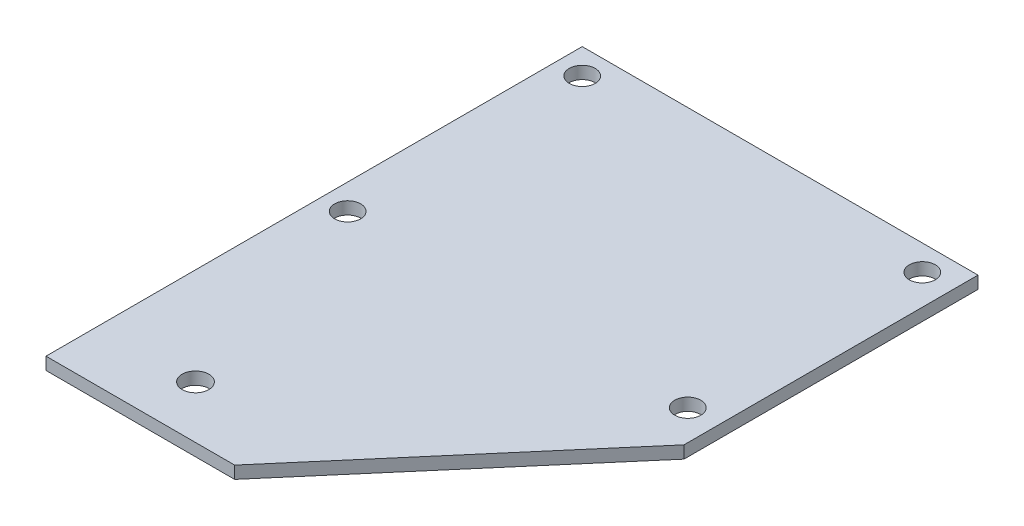
ISO-10303-21;
HEADER;
FILE_DESCRIPTION(('STEP AP214'),'2;1');
FILE_NAME('part.step','',(''),(''),'','','');
FILE_SCHEMA(('AUTOMOTIVE_DESIGN { 1 0 10303 214 1 1 1 1 }'));
ENDSEC;
DATA;
#1=APPLICATION_CONTEXT('core data for automotive mechanical design processes');
#2=APPLICATION_PROTOCOL_DEFINITION('international standard','automotive_design',2000,#1);
#3=PRODUCT_CONTEXT('',#1,'mechanical');
#4=PRODUCT('Part','Part','',(#3));
#5=PRODUCT_RELATED_PRODUCT_CATEGORY('part','',(#4));
#6=PRODUCT_DEFINITION_FORMATION('','',#4);
#7=PRODUCT_DEFINITION_CONTEXT('part definition',#1,'design');
#8=PRODUCT_DEFINITION('design','',#6,#7);
#9=PRODUCT_DEFINITION_SHAPE('','',#8);
#10=(LENGTH_UNIT() NAMED_UNIT(*) SI_UNIT(.MILLI.,.METRE.));
#11=(NAMED_UNIT(*) PLANE_ANGLE_UNIT() SI_UNIT($,.RADIAN.));
#12=(NAMED_UNIT(*) SI_UNIT($,.STERADIAN.) SOLID_ANGLE_UNIT());
#13=UNCERTAINTY_MEASURE_WITH_UNIT(LENGTH_MEASURE(1.E-05),#10,'distance_accuracy_value','');
#14=(GEOMETRIC_REPRESENTATION_CONTEXT(3) GLOBAL_UNCERTAINTY_ASSIGNED_CONTEXT((#13)) GLOBAL_UNIT_ASSIGNED_CONTEXT((#10,
#11,#12)) REPRESENTATION_CONTEXT('',''));
#15=CARTESIAN_POINT('',(0.,0.,0.));
#16=DIRECTION('',(0.,0.,1.));
#17=DIRECTION('',(1.,0.,0.));
#18=AXIS2_PLACEMENT_3D('',#15,#16,#17);
#19=CARTESIAN_POINT('',(0.,3.175,0.));
#20=DIRECTION('',(0.,-1.,0.));
#21=DIRECTION('',(0.,0.,-1.));
#22=AXIS2_PLACEMENT_3D('',#19,#20,#21);
#23=PLANE('',#22);
#24=DIRECTION('',(0.,0.,-1.));
#25=VECTOR('',#24,1.);
#26=CARTESIAN_POINT('',(101.24,3.175,-68.58));
#27=LINE('',#26,#25);
#28=CARTESIAN_POINT('',(101.24,3.175,6.62));
#29=VERTEX_POINT('',#28);
#30=CARTESIAN_POINT('',(101.24,3.175,-68.58));
#31=VERTEX_POINT('',#30);
#32=EDGE_CURVE('E119',#29,#31,#27,.T.);
#33=ORIENTED_EDGE('',*,*,#32,.T.);
#34=DIRECTION('',(-1.,0.,0.));
#35=VECTOR('',#34,1.);
#36=CARTESIAN_POINT('',(0.,3.175,-68.58));
#37=LINE('',#36,#35);
#38=CARTESIAN_POINT('',(0.,3.175,-68.58));
#39=VERTEX_POINT('',#38);
#40=EDGE_CURVE('E86',#31,#39,#37,.T.);
#41=ORIENTED_EDGE('',*,*,#40,.T.);
#42=DIRECTION('',(0.,0.,1.));
#43=VECTOR('',#42,1.);
#44=CARTESIAN_POINT('',(0.,3.175,68.58));
#45=LINE('',#44,#43);
#46=CARTESIAN_POINT('',(0.,3.175,68.58));
#47=VERTEX_POINT('',#46);
#48=EDGE_CURVE('E90',#39,#47,#45,.T.);
#49=ORIENTED_EDGE('',*,*,#48,.T.);
#50=DIRECTION('',(1.,0.,0.));
#51=VECTOR('',#50,1.);
#52=CARTESIAN_POINT('',(48.26,3.175,68.58));
#53=LINE('',#52,#51);
#54=CARTESIAN_POINT('',(48.26,3.175,68.58));
#55=VERTEX_POINT('',#54);
#56=EDGE_CURVE('E94',#47,#55,#53,.T.);
#57=ORIENTED_EDGE('',*,*,#56,.T.);
#58=DIRECTION('',(0.649881739167687,0.,-0.760035344636276));
#59=VECTOR('',#58,1.);
#60=CARTESIAN_POINT('',(101.24,3.175,6.62));
#61=LINE('',#60,#59);
#62=EDGE_CURVE('E52',#55,#29,#61,.T.);
#63=ORIENTED_EDGE('',*,*,#62,.T.);
#64=EDGE_LOOP('',(#33,#41,#49,#57,#63));
#65=FACE_BOUND('',#64,.T.);
#66=CARTESIAN_POINT('',(93.5,3.175,-62.08));
#67=DIRECTION('',(0.,1.,0.));
#68=DIRECTION('',(0.,0.,1.));
#69=AXIS2_PLACEMENT_3D('',#66,#67,#68);
#70=CIRCLE('',#69,3.32999999999999);
#71=CARTESIAN_POINT('',(93.5,3.175,-58.75));
#72=VERTEX_POINT('',#71);
#73=EDGE_CURVE('E114',#72,#72,#70,.T.);
#74=ORIENTED_EDGE('',*,*,#73,.F.);
#75=EDGE_LOOP('',(#74));
#76=FACE_BOUND('',#75,.T.);
#77=CARTESIAN_POINT('',(6.5,3.175,-62.08));
#78=DIRECTION('',(0.,1.,0.));
#79=DIRECTION('',(0.,0.,1.));
#80=AXIS2_PLACEMENT_3D('',#77,#78,#79);
#81=CIRCLE('',#80,3.33000000000001);
#82=CARTESIAN_POINT('',(6.5,3.175,-58.75));
#83=VERTEX_POINT('',#82);
#84=EDGE_CURVE('E188',#83,#83,#81,.T.);
#85=ORIENTED_EDGE('',*,*,#84,.F.);
#86=EDGE_LOOP('',(#85));
#87=FACE_BOUND('',#86,.T.);
#88=CARTESIAN_POINT('',(93.5,3.175,-2.08000000000001));
#89=DIRECTION('',(0.,1.,0.));
#90=DIRECTION('',(0.,0.,1.));
#91=AXIS2_PLACEMENT_3D('',#88,#89,#90);
#92=CIRCLE('',#91,3.32999999999999);
#93=CARTESIAN_POINT('',(93.5,3.175,1.24999999999999));
#94=VERTEX_POINT('',#93);
#95=EDGE_CURVE('E182',#94,#94,#92,.T.);
#96=ORIENTED_EDGE('',*,*,#95,.F.);
#97=EDGE_LOOP('',(#96));
#98=FACE_BOUND('',#97,.T.);
#99=CARTESIAN_POINT('',(6.50000000000001,3.175,-2.08));
#100=DIRECTION('',(0.,1.,0.));
#101=DIRECTION('',(0.,0.,1.));
#102=AXIS2_PLACEMENT_3D('',#99,#100,#101);
#103=CIRCLE('',#102,3.33);
#104=CARTESIAN_POINT('',(6.50000000000001,3.175,1.25));
#105=VERTEX_POINT('',#104);
#106=EDGE_CURVE('E176',#105,#105,#103,.T.);
#107=ORIENTED_EDGE('',*,*,#106,.F.);
#108=EDGE_LOOP('',(#107));
#109=FACE_BOUND('',#108,.T.);
#110=CARTESIAN_POINT('',(24.82,3.175,55.16));
#111=DIRECTION('',(0.,1.,0.));
#112=DIRECTION('',(0.,0.,1.));
#113=AXIS2_PLACEMENT_3D('',#110,#111,#112);
#114=CIRCLE('',#113,3.41999999999999);
#115=CARTESIAN_POINT('',(24.82,3.175,58.58));
#116=VERTEX_POINT('',#115);
#117=EDGE_CURVE('E167',#116,#116,#114,.T.);
#118=ORIENTED_EDGE('',*,*,#117,.F.);
#119=EDGE_LOOP('',(#118));
#120=FACE_BOUND('',#119,.T.);
#121=ADVANCED_FACE('F35',(#65,#76,#87,#98,#109,#120),#23,.F.);
#122=CARTESIAN_POINT('',(0.,0.,0.));
#123=DIRECTION('',(0.,-1.,0.));
#124=DIRECTION('',(0.,0.,-1.));
#125=AXIS2_PLACEMENT_3D('',#122,#123,#124);
#126=PLANE('',#125);
#127=CARTESIAN_POINT('',(6.50000000000001,0.,-2.08));
#128=DIRECTION('',(0.,1.,0.));
#129=DIRECTION('',(0.,0.,1.));
#130=AXIS2_PLACEMENT_3D('',#127,#128,#129);
#131=CIRCLE('',#130,3.33);
#132=CARTESIAN_POINT('',(6.50000000000001,0.,1.25));
#133=VERTEX_POINT('',#132);
#134=EDGE_CURVE('E173',#133,#133,#131,.T.);
#135=ORIENTED_EDGE('',*,*,#134,.T.);
#136=EDGE_LOOP('',(#135));
#137=FACE_BOUND('',#136,.T.);
#138=CARTESIAN_POINT('',(6.5,0.,-62.08));
#139=DIRECTION('',(0.,1.,0.));
#140=DIRECTION('',(0.,0.,1.));
#141=AXIS2_PLACEMENT_3D('',#138,#139,#140);
#142=CIRCLE('',#141,3.33000000000001);
#143=CARTESIAN_POINT('',(6.5,0.,-58.75));
#144=VERTEX_POINT('',#143);
#145=EDGE_CURVE('E185',#144,#144,#142,.T.);
#146=ORIENTED_EDGE('',*,*,#145,.T.);
#147=EDGE_LOOP('',(#146));
#148=FACE_BOUND('',#147,.T.);
#149=DIRECTION('',(0.,0.,-1.));
#150=VECTOR('',#149,1.);
#151=CARTESIAN_POINT('',(101.24,0.,-68.58));
#152=LINE('',#151,#150);
#153=CARTESIAN_POINT('',(101.24,0.,6.62));
#154=VERTEX_POINT('',#153);
#155=CARTESIAN_POINT('',(101.24,0.,-68.58));
#156=VERTEX_POINT('',#155);
#157=EDGE_CURVE('E110',#154,#156,#152,.T.);
#158=ORIENTED_EDGE('',*,*,#157,.F.);
#159=DIRECTION('',(0.649881739167687,0.,-0.760035344636276));
#160=VECTOR('',#159,1.);
#161=CARTESIAN_POINT('',(101.24,0.,6.62));
#162=LINE('',#161,#160);
#163=CARTESIAN_POINT('',(48.26,0.,68.58));
#164=VERTEX_POINT('',#163);
#165=EDGE_CURVE('E78',#164,#154,#162,.T.);
#166=ORIENTED_EDGE('',*,*,#165,.F.);
#167=DIRECTION('',(1.,0.,0.));
#168=VECTOR('',#167,1.);
#169=CARTESIAN_POINT('',(48.26,0.,68.58));
#170=LINE('',#169,#168);
#171=CARTESIAN_POINT('',(0.,0.,68.58));
#172=VERTEX_POINT('',#171);
#173=EDGE_CURVE('E72',#172,#164,#170,.T.);
#174=ORIENTED_EDGE('',*,*,#173,.F.);
#175=DIRECTION('',(0.,0.,1.));
#176=VECTOR('',#175,1.);
#177=CARTESIAN_POINT('',(0.,0.,68.58));
#178=LINE('',#177,#176);
#179=CARTESIAN_POINT('',(0.,0.,-68.58));
#180=VERTEX_POINT('',#179);
#181=EDGE_CURVE('E101',#180,#172,#178,.T.);
#182=ORIENTED_EDGE('',*,*,#181,.F.);
#183=DIRECTION('',(-1.,0.,0.));
#184=VECTOR('',#183,1.);
#185=CARTESIAN_POINT('',(0.,0.,-68.58));
#186=LINE('',#185,#184);
#187=EDGE_CURVE('E113',#156,#180,#186,.T.);
#188=ORIENTED_EDGE('',*,*,#187,.F.);
#189=EDGE_LOOP('',(#158,#166,#174,#182,#188));
#190=FACE_BOUND('',#189,.T.);
#191=CARTESIAN_POINT('',(93.5,0.,-62.08));
#192=DIRECTION('',(0.,1.,0.));
#193=DIRECTION('',(0.,0.,1.));
#194=AXIS2_PLACEMENT_3D('',#191,#192,#193);
#195=CIRCLE('',#194,3.32999999999999);
#196=CARTESIAN_POINT('',(93.5,0.,-58.75));
#197=VERTEX_POINT('',#196);
#198=EDGE_CURVE('E191',#197,#197,#195,.T.);
#199=ORIENTED_EDGE('',*,*,#198,.T.);
#200=EDGE_LOOP('',(#199));
#201=FACE_BOUND('',#200,.T.);
#202=CARTESIAN_POINT('',(93.5,0.,-2.08000000000001));
#203=DIRECTION('',(0.,1.,0.));
#204=DIRECTION('',(0.,0.,1.));
#205=AXIS2_PLACEMENT_3D('',#202,#203,#204);
#206=CIRCLE('',#205,3.32999999999999);
#207=CARTESIAN_POINT('',(93.5,0.,1.24999999999999));
#208=VERTEX_POINT('',#207);
#209=EDGE_CURVE('E179',#208,#208,#206,.T.);
#210=ORIENTED_EDGE('',*,*,#209,.T.);
#211=EDGE_LOOP('',(#210));
#212=FACE_BOUND('',#211,.T.);
#213=CARTESIAN_POINT('',(24.82,0.,55.16));
#214=DIRECTION('',(0.,1.,0.));
#215=DIRECTION('',(0.,0.,1.));
#216=AXIS2_PLACEMENT_3D('',#213,#214,#215);
#217=CIRCLE('',#216,3.41999999999999);
#218=CARTESIAN_POINT('',(24.82,0.,58.58));
#219=VERTEX_POINT('',#218);
#220=EDGE_CURVE('E170',#219,#219,#217,.T.);
#221=ORIENTED_EDGE('',*,*,#220,.T.);
#222=EDGE_LOOP('',(#221));
#223=FACE_BOUND('',#222,.T.);
#224=ADVANCED_FACE('F123',(#137,#148,#190,#201,#212,#223),#126,.T.);
#225=CARTESIAN_POINT('',(101.24,3.175,-68.58));
#226=DIRECTION('',(-1.,0.,0.));
#227=DIRECTION('',(0.,0.,1.));
#228=AXIS2_PLACEMENT_3D('',#225,#226,#227);
#229=PLANE('',#228);
#230=ORIENTED_EDGE('',*,*,#157,.T.);
#231=DIRECTION('',(0.,-1.,0.));
#232=VECTOR('',#231,1.);
#233=CARTESIAN_POINT('',(101.24,3.175,-68.58));
#234=LINE('',#233,#232);
#235=EDGE_CURVE('E11',#31,#156,#234,.T.);
#236=ORIENTED_EDGE('',*,*,#235,.F.);
#237=ORIENTED_EDGE('',*,*,#32,.F.);
#238=DIRECTION('',(0.,-1.,0.));
#239=VECTOR('',#238,1.);
#240=CARTESIAN_POINT('',(101.24,3.175,6.62));
#241=LINE('',#240,#239);
#242=EDGE_CURVE('E106',#29,#154,#241,.T.);
#243=ORIENTED_EDGE('',*,*,#242,.T.);
#244=EDGE_LOOP('',(#230,#236,#237,#243));
#245=FACE_BOUND('',#244,.T.);
#246=ADVANCED_FACE('F37',(#245),#229,.F.);
#247=CARTESIAN_POINT('',(0.,3.175,-68.58));
#248=DIRECTION('',(0.,0.,1.));
#249=DIRECTION('',(1.,0.,0.));
#250=AXIS2_PLACEMENT_3D('',#247,#248,#249);
#251=PLANE('',#250);
#252=ORIENTED_EDGE('',*,*,#187,.T.);
#253=DIRECTION('',(0.,-1.,0.));
#254=VECTOR('',#253,1.);
#255=CARTESIAN_POINT('',(0.,3.175,-68.58));
#256=LINE('',#255,#254);
#257=EDGE_CURVE('E44',#39,#180,#256,.T.);
#258=ORIENTED_EDGE('',*,*,#257,.F.);
#259=ORIENTED_EDGE('',*,*,#40,.F.);
#260=ORIENTED_EDGE('',*,*,#235,.T.);
#261=EDGE_LOOP('',(#252,#258,#259,#260));
#262=FACE_BOUND('',#261,.T.);
#263=ADVANCED_FACE('F251',(#262),#251,.F.);
#264=CARTESIAN_POINT('',(0.,3.175,68.58));
#265=DIRECTION('',(1.,0.,0.));
#266=DIRECTION('',(0.,0.,-1.));
#267=AXIS2_PLACEMENT_3D('',#264,#265,#266);
#268=PLANE('',#267);
#269=ORIENTED_EDGE('',*,*,#181,.T.);
#270=DIRECTION('',(0.,-1.,0.));
#271=VECTOR('',#270,1.);
#272=CARTESIAN_POINT('',(0.,3.175,68.58));
#273=LINE('',#272,#271);
#274=EDGE_CURVE('E98',#47,#172,#273,.T.);
#275=ORIENTED_EDGE('',*,*,#274,.F.);
#276=ORIENTED_EDGE('',*,*,#48,.F.);
#277=ORIENTED_EDGE('',*,*,#257,.T.);
#278=EDGE_LOOP('',(#269,#275,#276,#277));
#279=FACE_BOUND('',#278,.T.);
#280=ADVANCED_FACE('F99',(#279),#268,.F.);
#281=CARTESIAN_POINT('',(48.26,3.175,68.58));
#282=DIRECTION('',(0.,0.,-1.));
#283=DIRECTION('',(-1.,0.,0.));
#284=AXIS2_PLACEMENT_3D('',#281,#282,#283);
#285=PLANE('',#284);
#286=ORIENTED_EDGE('',*,*,#173,.T.);
#287=DIRECTION('',(0.,-1.,0.));
#288=VECTOR('',#287,1.);
#289=CARTESIAN_POINT('',(48.26,3.175,68.58));
#290=LINE('',#289,#288);
#291=EDGE_CURVE('E102',#55,#164,#290,.T.);
#292=ORIENTED_EDGE('',*,*,#291,.F.);
#293=ORIENTED_EDGE('',*,*,#56,.F.);
#294=ORIENTED_EDGE('',*,*,#274,.T.);
#295=EDGE_LOOP('',(#286,#292,#293,#294));
#296=FACE_BOUND('',#295,.T.);
#297=ADVANCED_FACE('F104',(#296),#285,.F.);
#298=CARTESIAN_POINT('',(101.24,3.175,6.62));
#299=DIRECTION('',(-0.760035344636276,0.,-0.649881739167687));
#300=DIRECTION('',(-0.649881739167687,0.,0.760035344636276));
#301=AXIS2_PLACEMENT_3D('',#298,#299,#300);
#302=PLANE('',#301);
#303=ORIENTED_EDGE('',*,*,#165,.T.);
#304=ORIENTED_EDGE('',*,*,#242,.F.);
#305=ORIENTED_EDGE('',*,*,#62,.F.);
#306=ORIENTED_EDGE('',*,*,#291,.T.);
#307=EDGE_LOOP('',(#303,#304,#305,#306));
#308=FACE_BOUND('',#307,.T.);
#309=ADVANCED_FACE('F128',(#308),#302,.F.);
#310=CARTESIAN_POINT('',(93.5,3.175,-62.08));
#311=DIRECTION('',(0.,-1.,0.));
#312=DIRECTION('',(0.,0.,-1.));
#313=AXIS2_PLACEMENT_3D('',#310,#311,#312);
#314=CYLINDRICAL_SURFACE('',#313,3.32999999999999);
#315=ORIENTED_EDGE('',*,*,#73,.T.);
#316=EDGE_LOOP('',(#315));
#317=FACE_BOUND('',#316,.T.);
#318=ORIENTED_EDGE('',*,*,#198,.F.);
#319=EDGE_LOOP('',(#318));
#320=FACE_BOUND('',#319,.T.);
#321=ADVANCED_FACE('F130',(#317,#320),#314,.F.);
#322=CARTESIAN_POINT('',(6.5,3.175,-62.08));
#323=DIRECTION('',(0.,-1.,0.));
#324=DIRECTION('',(0.,0.,-1.));
#325=AXIS2_PLACEMENT_3D('',#322,#323,#324);
#326=CYLINDRICAL_SURFACE('',#325,3.33000000000001);
#327=ORIENTED_EDGE('',*,*,#84,.T.);
#328=EDGE_LOOP('',(#327));
#329=FACE_BOUND('',#328,.T.);
#330=ORIENTED_EDGE('',*,*,#145,.F.);
#331=EDGE_LOOP('',(#330));
#332=FACE_BOUND('',#331,.T.);
#333=ADVANCED_FACE('F136',(#329,#332),#326,.F.);
#334=CARTESIAN_POINT('',(93.5,3.175,-2.08000000000001));
#335=DIRECTION('',(0.,-1.,0.));
#336=DIRECTION('',(0.,0.,-1.));
#337=AXIS2_PLACEMENT_3D('',#334,#335,#336);
#338=CYLINDRICAL_SURFACE('',#337,3.32999999999999);
#339=ORIENTED_EDGE('',*,*,#95,.T.);
#340=EDGE_LOOP('',(#339));
#341=FACE_BOUND('',#340,.T.);
#342=ORIENTED_EDGE('',*,*,#209,.F.);
#343=EDGE_LOOP('',(#342));
#344=FACE_BOUND('',#343,.T.);
#345=ADVANCED_FACE('F150',(#341,#344),#338,.F.);
#346=CARTESIAN_POINT('',(6.50000000000001,3.175,-2.08));
#347=DIRECTION('',(0.,-1.,0.));
#348=DIRECTION('',(0.,0.,-1.));
#349=AXIS2_PLACEMENT_3D('',#346,#347,#348);
#350=CYLINDRICAL_SURFACE('',#349,3.33);
#351=ORIENTED_EDGE('',*,*,#106,.T.);
#352=EDGE_LOOP('',(#351));
#353=FACE_BOUND('',#352,.T.);
#354=ORIENTED_EDGE('',*,*,#134,.F.);
#355=EDGE_LOOP('',(#354));
#356=FACE_BOUND('',#355,.T.);
#357=ADVANCED_FACE('F154',(#353,#356),#350,.F.);
#358=CARTESIAN_POINT('',(24.82,3.175,55.16));
#359=DIRECTION('',(0.,-1.,0.));
#360=DIRECTION('',(0.,0.,-1.));
#361=AXIS2_PLACEMENT_3D('',#358,#359,#360);
#362=CYLINDRICAL_SURFACE('',#361,3.41999999999999);
#363=ORIENTED_EDGE('',*,*,#117,.T.);
#364=EDGE_LOOP('',(#363));
#365=FACE_BOUND('',#364,.T.);
#366=ORIENTED_EDGE('',*,*,#220,.F.);
#367=EDGE_LOOP('',(#366));
#368=FACE_BOUND('',#367,.T.);
#369=ADVANCED_FACE('F158',(#365,#368),#362,.F.);
#370=CLOSED_SHELL('',(#121,#224,#246,#263,#280,#297,#309,#321,#333,#345,#357,#369));
#371=MANIFOLD_SOLID_BREP('B2',#370);
#372=ADVANCED_BREP_SHAPE_REPRESENTATION('',(#18,#371),#14);
#373=SHAPE_DEFINITION_REPRESENTATION(#9,#372);
ENDSEC;
END-ISO-10303-21;
